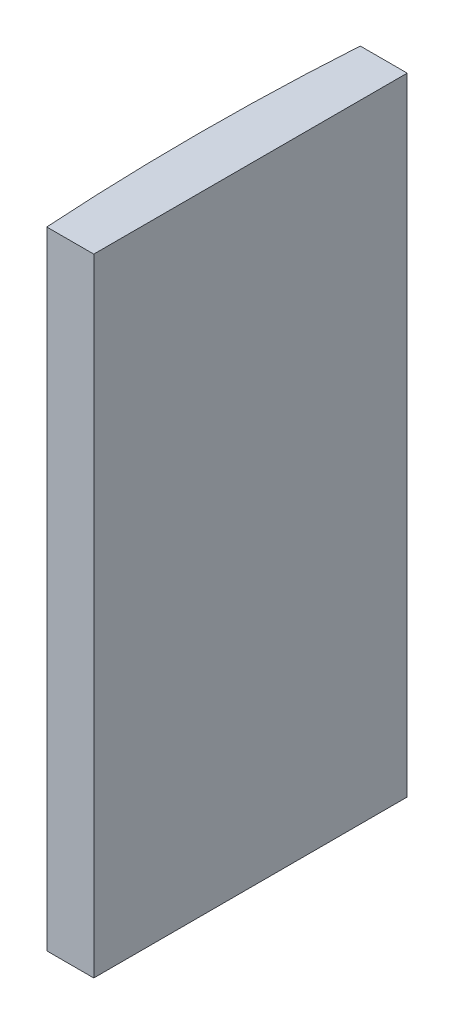
ISO-10303-21;
HEADER;
FILE_DESCRIPTION(('STEP AP214'),'2;1');
FILE_NAME('part.step','',(''),(''),'','','');
FILE_SCHEMA(('AUTOMOTIVE_DESIGN { 1 0 10303 214 1 1 1 1 }'));
ENDSEC;
DATA;
#1=APPLICATION_CONTEXT('core data for automotive mechanical design processes');
#2=APPLICATION_PROTOCOL_DEFINITION('international standard','automotive_design',2000,#1);
#3=PRODUCT_CONTEXT('',#1,'mechanical');
#4=PRODUCT('Part','Part','',(#3));
#5=PRODUCT_RELATED_PRODUCT_CATEGORY('part','',(#4));
#6=PRODUCT_DEFINITION_FORMATION('','',#4);
#7=PRODUCT_DEFINITION_CONTEXT('part definition',#1,'design');
#8=PRODUCT_DEFINITION('design','',#6,#7);
#9=PRODUCT_DEFINITION_SHAPE('','',#8);
#10=(LENGTH_UNIT() NAMED_UNIT(*) SI_UNIT(.MILLI.,.METRE.));
#11=(NAMED_UNIT(*) PLANE_ANGLE_UNIT() SI_UNIT($,.RADIAN.));
#12=(NAMED_UNIT(*) SI_UNIT($,.STERADIAN.) SOLID_ANGLE_UNIT());
#13=UNCERTAINTY_MEASURE_WITH_UNIT(LENGTH_MEASURE(1.E-05),#10,'distance_accuracy_value','');
#14=(GEOMETRIC_REPRESENTATION_CONTEXT(3) GLOBAL_UNCERTAINTY_ASSIGNED_CONTEXT((#13)) GLOBAL_UNIT_ASSIGNED_CONTEXT((#10,
#11,#12)) REPRESENTATION_CONTEXT('',''));
#15=CARTESIAN_POINT('',(0.,0.,0.));
#16=DIRECTION('',(0.,0.,1.));
#17=DIRECTION('',(1.,0.,0.));
#18=AXIS2_PLACEMENT_3D('',#15,#16,#17);
#19=CARTESIAN_POINT('',(4.35520433485127,40.,0.));
#20=DIRECTION('',(0.,-1.,0.));
#21=DIRECTION('',(0.,0.,-1.));
#22=AXIS2_PLACEMENT_3D('',#19,#20,#21);
#23=CYLINDRICAL_SURFACE('',#22,155.1);
#24=CARTESIAN_POINT('',(4.35520433485127,0.,0.));
#25=DIRECTION('',(0.,1.,0.));
#26=DIRECTION('',(0.,0.,1.));
#27=AXIS2_PLACEMENT_3D('',#24,#25,#26);
#28=CIRCLE('',#27,155.1);
#29=CARTESIAN_POINT('',(-150.422087281199,0.,-10.));
#30=VERTEX_POINT('',#29);
#31=CARTESIAN_POINT('',(-150.422087281199,0.,10.));
#32=VERTEX_POINT('',#31);
#33=EDGE_CURVE('E100',#30,#32,#28,.T.);
#34=ORIENTED_EDGE('',*,*,#33,.T.);
#35=DIRECTION('',(0.,-1.,0.));
#36=VECTOR('',#35,1.);
#37=CARTESIAN_POINT('',(-150.422087281199,40.,10.));
#38=LINE('',#37,#36);
#39=CARTESIAN_POINT('',(-150.422087281199,40.,10.));
#40=VERTEX_POINT('',#39);
#41=EDGE_CURVE('E11',#40,#32,#38,.T.);
#42=ORIENTED_EDGE('',*,*,#41,.F.);
#43=CARTESIAN_POINT('',(4.35520433485127,40.,0.));
#44=DIRECTION('',(0.,1.,0.));
#45=DIRECTION('',(0.,0.,1.));
#46=AXIS2_PLACEMENT_3D('',#43,#44,#45);
#47=CIRCLE('',#46,155.1);
#48=CARTESIAN_POINT('',(-150.422087281199,40.,-10.));
#49=VERTEX_POINT('',#48);
#50=EDGE_CURVE('E88',#49,#40,#47,.T.);
#51=ORIENTED_EDGE('',*,*,#50,.F.);
#52=DIRECTION('',(0.,-1.,0.));
#53=VECTOR('',#52,1.);
#54=CARTESIAN_POINT('',(-150.422087281199,40.,-10.));
#55=LINE('',#54,#53);
#56=EDGE_CURVE('E96',#49,#30,#55,.T.);
#57=ORIENTED_EDGE('',*,*,#56,.T.);
#58=EDGE_LOOP('',(#34,#42,#51,#57));
#59=FACE_BOUND('',#58,.T.);
#60=ADVANCED_FACE('F37',(#59),#23,.T.);
#61=CARTESIAN_POINT('',(-150.422087281199,40.,10.));
#62=DIRECTION('',(0.,0.,-1.));
#63=DIRECTION('',(-1.,0.,0.));
#64=AXIS2_PLACEMENT_3D('',#61,#62,#63);
#65=PLANE('',#64);
#66=DIRECTION('',(1.,0.,0.));
#67=VECTOR('',#66,1.);
#68=CARTESIAN_POINT('',(-150.422087281199,0.,10.));
#69=LINE('',#68,#67);
#70=CARTESIAN_POINT('',(-147.424795665149,0.,10.));
#71=VERTEX_POINT('',#70);
#72=EDGE_CURVE('E92',#32,#71,#69,.T.);
#73=ORIENTED_EDGE('',*,*,#72,.T.);
#74=DIRECTION('',(0.,-1.,0.));
#75=VECTOR('',#74,1.);
#76=CARTESIAN_POINT('',(-147.424795665149,40.,10.));
#77=LINE('',#76,#75);
#78=CARTESIAN_POINT('',(-147.424795665149,40.,10.));
#79=VERTEX_POINT('',#78);
#80=EDGE_CURVE('E45',#79,#71,#77,.T.);
#81=ORIENTED_EDGE('',*,*,#80,.F.);
#82=DIRECTION('',(1.,0.,0.));
#83=VECTOR('',#82,1.);
#84=CARTESIAN_POINT('',(-150.422087281199,40.,10.));
#85=LINE('',#84,#83);
#86=EDGE_CURVE('E83',#40,#79,#85,.T.);
#87=ORIENTED_EDGE('',*,*,#86,.F.);
#88=ORIENTED_EDGE('',*,*,#41,.T.);
#89=EDGE_LOOP('',(#73,#81,#87,#88));
#90=FACE_BOUND('',#89,.T.);
#91=ADVANCED_FACE('F91',(#90),#65,.F.);
#92=CARTESIAN_POINT('',(-147.424795665149,40.,-10.));
#93=DIRECTION('',(-1.,0.,0.));
#94=DIRECTION('',(0.,0.,1.));
#95=AXIS2_PLACEMENT_3D('',#92,#93,#94);
#96=PLANE('',#95);
#97=DIRECTION('',(0.,0.,-1.));
#98=VECTOR('',#97,1.);
#99=CARTESIAN_POINT('',(-147.424795665149,0.,-10.));
#100=LINE('',#99,#98);
#101=CARTESIAN_POINT('',(-147.424795665149,0.,-10.));
#102=VERTEX_POINT('',#101);
#103=EDGE_CURVE('E70',#71,#102,#100,.T.);
#104=ORIENTED_EDGE('',*,*,#103,.T.);
#105=DIRECTION('',(0.,-1.,0.));
#106=VECTOR('',#105,1.);
#107=CARTESIAN_POINT('',(-147.424795665149,40.,-10.));
#108=LINE('',#107,#106);
#109=CARTESIAN_POINT('',(-147.424795665149,40.,-10.));
#110=VERTEX_POINT('',#109);
#111=EDGE_CURVE('E93',#110,#102,#108,.T.);
#112=ORIENTED_EDGE('',*,*,#111,.F.);
#113=DIRECTION('',(0.,0.,-1.));
#114=VECTOR('',#113,1.);
#115=CARTESIAN_POINT('',(-147.424795665149,40.,-10.));
#116=LINE('',#115,#114);
#117=EDGE_CURVE('E86',#79,#110,#116,.T.);
#118=ORIENTED_EDGE('',*,*,#117,.F.);
#119=ORIENTED_EDGE('',*,*,#80,.T.);
#120=EDGE_LOOP('',(#104,#112,#118,#119));
#121=FACE_BOUND('',#120,.T.);
#122=ADVANCED_FACE('F94',(#121),#96,.F.);
#123=CARTESIAN_POINT('',(-150.422087281199,40.,-10.));
#124=DIRECTION('',(0.,0.,1.));
#125=DIRECTION('',(1.,0.,0.));
#126=AXIS2_PLACEMENT_3D('',#123,#124,#125);
#127=PLANE('',#126);
#128=DIRECTION('',(-1.,0.,0.));
#129=VECTOR('',#128,1.);
#130=CARTESIAN_POINT('',(-150.422087281199,0.,-10.));
#131=LINE('',#130,#129);
#132=EDGE_CURVE('E76',#102,#30,#131,.T.);
#133=ORIENTED_EDGE('',*,*,#132,.T.);
#134=ORIENTED_EDGE('',*,*,#56,.F.);
#135=DIRECTION('',(-1.,0.,0.));
#136=VECTOR('',#135,1.);
#137=CARTESIAN_POINT('',(-150.422087281199,40.,-10.));
#138=LINE('',#137,#136);
#139=EDGE_CURVE('E53',#110,#49,#138,.T.);
#140=ORIENTED_EDGE('',*,*,#139,.F.);
#141=ORIENTED_EDGE('',*,*,#111,.T.);
#142=EDGE_LOOP('',(#133,#134,#140,#141));
#143=FACE_BOUND('',#142,.T.);
#144=ADVANCED_FACE('F107',(#143),#127,.F.);
#145=CARTESIAN_POINT('',(4.35520433485127,40.,0.));
#146=DIRECTION('',(0.,1.,0.));
#147=DIRECTION('',(0.,0.,1.));
#148=AXIS2_PLACEMENT_3D('',#145,#146,#147);
#149=PLANE('',#148);
#150=ORIENTED_EDGE('',*,*,#50,.T.);
#151=ORIENTED_EDGE('',*,*,#86,.T.);
#152=ORIENTED_EDGE('',*,*,#117,.T.);
#153=ORIENTED_EDGE('',*,*,#139,.T.);
#154=EDGE_LOOP('',(#150,#151,#152,#153));
#155=FACE_BOUND('',#154,.T.);
#156=ADVANCED_FACE('F84',(#155),#149,.T.);
#157=CARTESIAN_POINT('',(4.35520433485127,0.,0.));
#158=DIRECTION('',(0.,1.,0.));
#159=DIRECTION('',(0.,0.,1.));
#160=AXIS2_PLACEMENT_3D('',#157,#158,#159);
#161=PLANE('',#160);
#162=ORIENTED_EDGE('',*,*,#33,.F.);
#163=ORIENTED_EDGE('',*,*,#132,.F.);
#164=ORIENTED_EDGE('',*,*,#103,.F.);
#165=ORIENTED_EDGE('',*,*,#72,.F.);
#166=EDGE_LOOP('',(#162,#163,#164,#165));
#167=FACE_BOUND('',#166,.T.);
#168=ADVANCED_FACE('F110',(#167),#161,.F.);
#169=CLOSED_SHELL('',(#60,#91,#122,#144,#156,#168));
#170=MANIFOLD_SOLID_BREP('B2',#169);
#171=ADVANCED_BREP_SHAPE_REPRESENTATION('',(#18,#170),#14);
#172=SHAPE_DEFINITION_REPRESENTATION(#9,#171);
ENDSEC;
END-ISO-10303-21;
